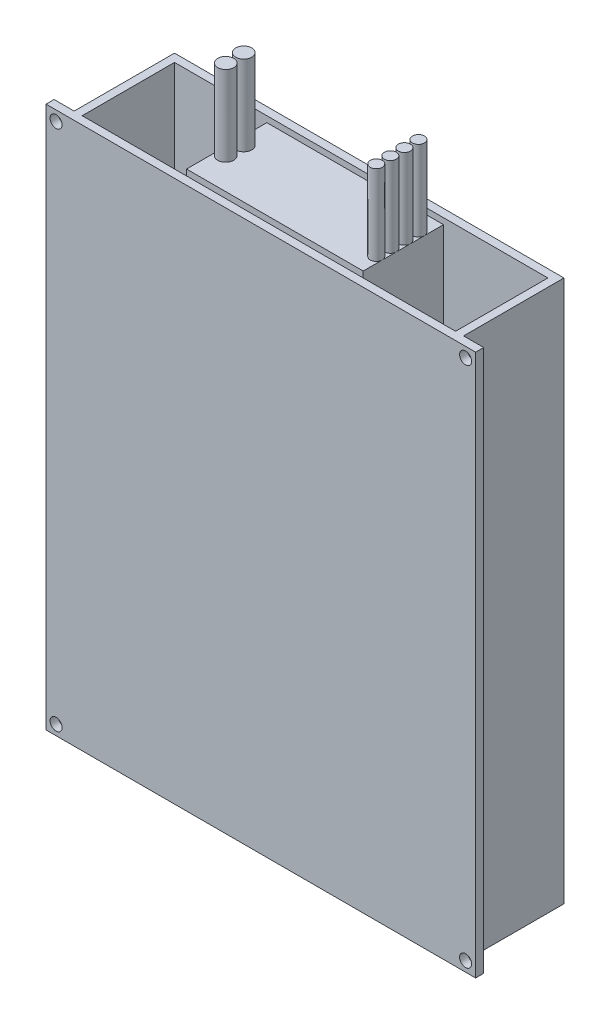
ISO-10303-21;
HEADER;
FILE_DESCRIPTION(('STEP AP214'),'2;1');
FILE_NAME('part.step','',(''),(''),'','','');
FILE_SCHEMA(('AUTOMOTIVE_DESIGN { 1 0 10303 214 1 1 1 1 }'));
ENDSEC;
DATA;
#1=APPLICATION_CONTEXT('core data for automotive mechanical design processes');
#2=APPLICATION_PROTOCOL_DEFINITION('international standard','automotive_design',2000,#1);
#3=PRODUCT_CONTEXT('',#1,'mechanical');
#4=PRODUCT('Part','Part','',(#3));
#5=PRODUCT_RELATED_PRODUCT_CATEGORY('part','',(#4));
#6=PRODUCT_DEFINITION_FORMATION('','',#4);
#7=PRODUCT_DEFINITION_CONTEXT('part definition',#1,'design');
#8=PRODUCT_DEFINITION('design','',#6,#7);
#9=PRODUCT_DEFINITION_SHAPE('','',#8);
#10=(LENGTH_UNIT() NAMED_UNIT(*) SI_UNIT(.MILLI.,.METRE.));
#11=(NAMED_UNIT(*) PLANE_ANGLE_UNIT() SI_UNIT($,.RADIAN.));
#12=(NAMED_UNIT(*) SI_UNIT($,.STERADIAN.) SOLID_ANGLE_UNIT());
#13=UNCERTAINTY_MEASURE_WITH_UNIT(LENGTH_MEASURE(1.E-05),#10,'distance_accuracy_value','');
#14=(GEOMETRIC_REPRESENTATION_CONTEXT(3) GLOBAL_UNCERTAINTY_ASSIGNED_CONTEXT((#13)) GLOBAL_UNIT_ASSIGNED_CONTEXT((#10,
#11,#12)) REPRESENTATION_CONTEXT('',''));
#15=CARTESIAN_POINT('',(0.,0.,0.));
#16=DIRECTION('',(0.,0.,1.));
#17=DIRECTION('',(1.,0.,0.));
#18=AXIS2_PLACEMENT_3D('',#15,#16,#17);
#19=CARTESIAN_POINT('',(0.,-70.0000000000004,-21.9067738994741));
#20=DIRECTION('',(0.,0.,1.));
#21=DIRECTION('',(0.,-1.,0.));
#22=AXIS2_PLACEMENT_3D('',#19,#20,#21);
#23=PLANE('',#22);
#24=CARTESIAN_POINT('',(-62.5797254283904,-67.5000000000003,-21.9067738994726));
#25=DIRECTION('',(0.,0.,-1.));
#26=DIRECTION('',(0.,1.,0.));
#27=AXIS2_PLACEMENT_3D('',#24,#25,#26);
#28=CIRCLE('',#27,1.5);
#29=CARTESIAN_POINT('',(-62.5797254283904,-66.0000000000003,-21.9067738994725));
#30=VERTEX_POINT('',#29);
#31=EDGE_CURVE('E270',#30,#30,#28,.F.);
#32=ORIENTED_EDGE('',*,*,#31,.F.);
#33=EDGE_LOOP('',(#32));
#34=FACE_BOUND('',#33,.T.);
#35=CARTESIAN_POINT('',(-164.579725428391,-67.5000000000003,-21.9067738994726));
#36=DIRECTION('',(0.,0.,-1.));
#37=DIRECTION('',(0.,1.,0.));
#38=AXIS2_PLACEMENT_3D('',#35,#36,#37);
#39=CIRCLE('',#38,1.50000000000003);
#40=CARTESIAN_POINT('',(-164.579725428391,-66.0000000000003,-21.9067738994725));
#41=VERTEX_POINT('',#40);
#42=EDGE_CURVE('E274',#41,#41,#39,.T.);
#43=ORIENTED_EDGE('',*,*,#42,.T.);
#44=EDGE_LOOP('',(#43));
#45=FACE_BOUND('',#44,.T.);
#46=CARTESIAN_POINT('',(-62.5797254283904,62.4999999999997,-21.9067738994712));
#47=DIRECTION('',(0.,0.,-1.));
#48=DIRECTION('',(0.,1.,0.));
#49=AXIS2_PLACEMENT_3D('',#46,#47,#48);
#50=CIRCLE('',#49,1.5);
#51=CARTESIAN_POINT('',(-62.5797254283904,63.9999999999997,-21.9067738994712));
#52=VERTEX_POINT('',#51);
#53=EDGE_CURVE('E163',#52,#52,#50,.T.);
#54=ORIENTED_EDGE('',*,*,#53,.T.);
#55=EDGE_LOOP('',(#54));
#56=FACE_BOUND('',#55,.T.);
#57=DIRECTION('',(1.,0.,0.));
#58=VECTOR('',#57,1.);
#59=CARTESIAN_POINT('',(0.,-70.0000000000004,-21.9067738994741));
#60=LINE('',#59,#58);
#61=CARTESIAN_POINT('',(-167.079725428391,-70.0000000000004,-21.906773899474));
#62=VERTEX_POINT('',#61);
#63=CARTESIAN_POINT('',(-60.0797254283904,-70.0000000000004,-21.906773899474));
#64=VERTEX_POINT('',#63);
#65=EDGE_CURVE('E161',#62,#64,#60,.T.);
#66=ORIENTED_EDGE('',*,*,#65,.T.);
#67=DIRECTION('',(0.,-1.,0.));
#68=VECTOR('',#67,1.);
#69=CARTESIAN_POINT('',(-60.0797254283904,70.3851648071343,-21.9067738994725));
#70=LINE('',#69,#68);
#71=CARTESIAN_POINT('',(-60.0797254283904,64.9999999999997,-21.9067738994726));
#72=VERTEX_POINT('',#71);
#73=EDGE_CURVE('E187',#72,#64,#70,.T.);
#74=ORIENTED_EDGE('',*,*,#73,.F.);
#75=DIRECTION('',(-1.,0.,0.));
#76=VECTOR('',#75,1.);
#77=CARTESIAN_POINT('',(0.,64.9999999999997,-21.9067738994727));
#78=LINE('',#77,#76);
#79=CARTESIAN_POINT('',(-167.079725428391,64.9999999999997,-21.9067738994726));
#80=VERTEX_POINT('',#79);
#81=EDGE_CURVE('E197',#72,#80,#78,.T.);
#82=ORIENTED_EDGE('',*,*,#81,.T.);
#83=DIRECTION('',(0.,-1.,0.));
#84=VECTOR('',#83,1.);
#85=CARTESIAN_POINT('',(-167.079725428391,70.3851648071343,-21.9067738994725));
#86=LINE('',#85,#84);
#87=EDGE_CURVE('E171',#80,#62,#86,.T.);
#88=ORIENTED_EDGE('',*,*,#87,.T.);
#89=EDGE_LOOP('',(#66,#74,#82,#88));
#90=FACE_BOUND('',#89,.T.);
#91=CARTESIAN_POINT('',(-164.579725428391,62.4999999999997,-21.9067738994712));
#92=DIRECTION('',(0.,0.,-1.));
#93=DIRECTION('',(0.,1.,0.));
#94=AXIS2_PLACEMENT_3D('',#91,#92,#93);
#95=CIRCLE('',#94,1.50000000000002);
#96=CARTESIAN_POINT('',(-164.579725428391,63.9999999999997,-21.9067738994712));
#97=VERTEX_POINT('',#96);
#98=EDGE_CURVE('E281',#97,#97,#95,.F.);
#99=ORIENTED_EDGE('',*,*,#98,.F.);
#100=EDGE_LOOP('',(#99));
#101=FACE_BOUND('',#100,.T.);
#102=ADVANCED_FACE('F49',(#34,#45,#56,#90,#101),#23,.T.);
#103=CARTESIAN_POINT('',(0.,70.3851648071344,-23.9067738994725));
#104=DIRECTION('',(0.,0.,-1.));
#105=DIRECTION('',(0.,1.,0.));
#106=AXIS2_PLACEMENT_3D('',#103,#104,#105);
#107=PLANE('',#106);
#108=DIRECTION('',(-1.,0.,0.));
#109=VECTOR('',#108,1.);
#110=CARTESIAN_POINT('',(0.,64.9999999999997,-23.9067738994726));
#111=LINE('',#110,#109);
#112=CARTESIAN_POINT('',(-60.0797254283904,64.9999999999997,-23.9067738994726));
#113=VERTEX_POINT('',#112);
#114=CARTESIAN_POINT('',(-65.0797254283904,64.9999999999997,-23.906773899474));
#115=VERTEX_POINT('',#114);
#116=EDGE_CURVE('E177',#113,#115,#111,.T.);
#117=ORIENTED_EDGE('',*,*,#116,.F.);
#118=DIRECTION('',(0.,-1.,0.));
#119=VECTOR('',#118,1.);
#120=CARTESIAN_POINT('',(-60.0797254283904,70.3851648071344,-23.9067738994725));
#121=LINE('',#120,#119);
#122=CARTESIAN_POINT('',(-60.0797254283904,-70.0000000000003,-23.906773899474));
#123=VERTEX_POINT('',#122);
#124=EDGE_CURVE('E180',#113,#123,#121,.T.);
#125=ORIENTED_EDGE('',*,*,#124,.T.);
#126=DIRECTION('',(1.,0.,0.));
#127=VECTOR('',#126,1.);
#128=CARTESIAN_POINT('',(0.,-70.0000000000003,-23.906773899474));
#129=LINE('',#128,#127);
#130=CARTESIAN_POINT('',(-65.0797254283904,-70.0000000000003,-23.906773899474));
#131=VERTEX_POINT('',#130);
#132=EDGE_CURVE('E72',#131,#123,#129,.T.);
#133=ORIENTED_EDGE('',*,*,#132,.F.);
#134=DIRECTION('',(0.,-1.,0.));
#135=VECTOR('',#134,1.);
#136=CARTESIAN_POINT('',(-65.0797254283904,70.3851648071344,-23.9067738994725));
#137=LINE('',#136,#135);
#138=EDGE_CURVE('E189',#115,#131,#137,.T.);
#139=ORIENTED_EDGE('',*,*,#138,.F.);
#140=EDGE_LOOP('',(#117,#125,#133,#139));
#141=FACE_BOUND('',#140,.T.);
#142=CARTESIAN_POINT('',(-62.5797254283904,62.4999999999997,-23.9067738994726));
#143=DIRECTION('',(0.,0.,-1.));
#144=DIRECTION('',(0.,1.,0.));
#145=AXIS2_PLACEMENT_3D('',#142,#143,#144);
#146=CIRCLE('',#145,1.5);
#147=CARTESIAN_POINT('',(-62.5797254283904,63.9999999999997,-23.9067738994726));
#148=VERTEX_POINT('',#147);
#149=EDGE_CURVE('E166',#148,#148,#146,.T.);
#150=ORIENTED_EDGE('',*,*,#149,.F.);
#151=EDGE_LOOP('',(#150));
#152=FACE_BOUND('',#151,.T.);
#153=CARTESIAN_POINT('',(-62.5797254283904,-67.5000000000003,-23.906773899474));
#154=DIRECTION('',(0.,0.,-1.));
#155=DIRECTION('',(0.,1.,0.));
#156=AXIS2_PLACEMENT_3D('',#153,#154,#155);
#157=CIRCLE('',#156,1.5);
#158=CARTESIAN_POINT('',(-62.5797254283904,-66.0000000000003,-23.906773899474));
#159=VERTEX_POINT('',#158);
#160=EDGE_CURVE('E293',#159,#159,#157,.F.);
#161=ORIENTED_EDGE('',*,*,#160,.T.);
#162=EDGE_LOOP('',(#161));
#163=FACE_BOUND('',#162,.T.);
#164=ADVANCED_FACE('F251',(#141,#152,#163),#107,.T.);
#165=CARTESIAN_POINT('',(0.,70.3851648071344,-23.9067738994725));
#166=DIRECTION('',(0.,0.,-1.));
#167=DIRECTION('',(0.,1.,0.));
#168=AXIS2_PLACEMENT_3D('',#165,#166,#167);
#169=PLANE('',#168);
#170=DIRECTION('',(-1.,0.,0.));
#171=VECTOR('',#170,1.);
#172=CARTESIAN_POINT('',(0.,64.9999999999997,-23.9067738994726));
#173=LINE('',#172,#171);
#174=CARTESIAN_POINT('',(-162.07972542839,64.9999999999997,-23.9067738994733));
#175=VERTEX_POINT('',#174);
#176=CARTESIAN_POINT('',(-167.079725428391,64.9999999999997,-23.9067738994726));
#177=VERTEX_POINT('',#176);
#178=EDGE_CURVE('E174',#175,#177,#173,.T.);
#179=ORIENTED_EDGE('',*,*,#178,.F.);
#180=DIRECTION('',(0.,-1.,0.));
#181=VECTOR('',#180,1.);
#182=CARTESIAN_POINT('',(-162.07972542839,70.3851648071344,-23.9067738994725));
#183=LINE('',#182,#181);
#184=CARTESIAN_POINT('',(-162.07972542839,-70.0000000000003,-23.906773899474));
#185=VERTEX_POINT('',#184);
#186=EDGE_CURVE('E64',#175,#185,#183,.T.);
#187=ORIENTED_EDGE('',*,*,#186,.T.);
#188=DIRECTION('',(1.,0.,0.));
#189=VECTOR('',#188,1.);
#190=CARTESIAN_POINT('',(0.,-70.0000000000003,-23.906773899474));
#191=LINE('',#190,#189);
#192=CARTESIAN_POINT('',(-167.079725428391,-70.0000000000003,-23.906773899474));
#193=VERTEX_POINT('',#192);
#194=EDGE_CURVE('E150',#193,#185,#191,.T.);
#195=ORIENTED_EDGE('',*,*,#194,.F.);
#196=DIRECTION('',(0.,-1.,0.));
#197=VECTOR('',#196,1.);
#198=CARTESIAN_POINT('',(-167.079725428391,70.3851648071344,-23.9067738994725));
#199=LINE('',#198,#197);
#200=EDGE_CURVE('E140',#177,#193,#199,.T.);
#201=ORIENTED_EDGE('',*,*,#200,.F.);
#202=EDGE_LOOP('',(#179,#187,#195,#201));
#203=FACE_BOUND('',#202,.T.);
#204=CARTESIAN_POINT('',(-164.579725428391,-67.5000000000003,-23.906773899474));
#205=DIRECTION('',(0.,0.,-1.));
#206=DIRECTION('',(0.,1.,0.));
#207=AXIS2_PLACEMENT_3D('',#204,#205,#206);
#208=CIRCLE('',#207,1.50000000000003);
#209=CARTESIAN_POINT('',(-164.579725428391,-66.0000000000003,-23.906773899474));
#210=VERTEX_POINT('',#209);
#211=EDGE_CURVE('E289',#210,#210,#208,.T.);
#212=ORIENTED_EDGE('',*,*,#211,.F.);
#213=EDGE_LOOP('',(#212));
#214=FACE_BOUND('',#213,.T.);
#215=CARTESIAN_POINT('',(-164.579725428391,62.4999999999997,-23.9067738994726));
#216=DIRECTION('',(0.,0.,-1.));
#217=DIRECTION('',(0.,1.,0.));
#218=AXIS2_PLACEMENT_3D('',#215,#216,#217);
#219=CIRCLE('',#218,1.50000000000002);
#220=CARTESIAN_POINT('',(-164.579725428391,63.9999999999997,-23.9067738994726));
#221=VERTEX_POINT('',#220);
#222=EDGE_CURVE('E283',#221,#221,#219,.F.);
#223=ORIENTED_EDGE('',*,*,#222,.T.);
#224=EDGE_LOOP('',(#223));
#225=FACE_BOUND('',#224,.T.);
#226=ADVANCED_FACE('F153',(#203,#214,#225),#169,.T.);
#227=CARTESIAN_POINT('',(-65.0797254283904,-70.0000000000006,-7.30598239080664E-13));
#228=DIRECTION('',(-1.,0.,0.));
#229=DIRECTION('',(0.,-1.,0.));
#230=AXIS2_PLACEMENT_3D('',#227,#228,#229);
#231=PLANE('',#230);
#232=DIRECTION('',(0.,0.,-1.));
#233=VECTOR('',#232,1.);
#234=CARTESIAN_POINT('',(-65.0797254283904,64.9999999999995,6.83451703150806E-13));
#235=LINE('',#234,#233);
#236=CARTESIAN_POINT('',(-65.0797254283904,65.,-48.9067738994723));
#237=VERTEX_POINT('',#236);
#238=EDGE_CURVE('E208',#115,#237,#235,.T.);
#239=ORIENTED_EDGE('',*,*,#238,.F.);
#240=ORIENTED_EDGE('',*,*,#138,.T.);
#241=DIRECTION('',(0.,0.,1.));
#242=VECTOR('',#241,1.);
#243=CARTESIAN_POINT('',(-65.0797254283904,-70.0000000000006,-7.30598239080664E-13));
#244=LINE('',#243,#242);
#245=CARTESIAN_POINT('',(-65.0797254283904,-70.0000000000001,-48.9067738994738));
#246=VERTEX_POINT('',#245);
#247=EDGE_CURVE('E210',#246,#131,#244,.T.);
#248=ORIENTED_EDGE('',*,*,#247,.F.);
#249=DIRECTION('',(0.,1.,0.));
#250=VECTOR('',#249,1.);
#251=CARTESIAN_POINT('',(-65.0797254283904,-70.0000000000001,-48.9067738994738));
#252=LINE('',#251,#250);
#253=EDGE_CURVE('E57',#246,#237,#252,.T.);
#254=ORIENTED_EDGE('',*,*,#253,.T.);
#255=EDGE_LOOP('',(#239,#240,#248,#254));
#256=FACE_BOUND('',#255,.T.);
#257=ADVANCED_FACE('F51',(#256),#231,.F.);
#258=CARTESIAN_POINT('',(-162.07972542839,-70.0000000000006,-7.30598239080664E-13));
#259=DIRECTION('',(-1.,0.,0.));
#260=DIRECTION('',(0.,-1.,0.));
#261=AXIS2_PLACEMENT_3D('',#258,#259,#260);
#262=PLANE('',#261);
#263=ORIENTED_EDGE('',*,*,#186,.F.);
#264=DIRECTION('',(0.,0.,-1.));
#265=VECTOR('',#264,1.);
#266=CARTESIAN_POINT('',(-162.07972542839,64.9999999999995,6.83451703150806E-13));
#267=LINE('',#266,#265);
#268=CARTESIAN_POINT('',(-162.07972542839,65.,-48.9067738994737));
#269=VERTEX_POINT('',#268);
#270=EDGE_CURVE('E201',#175,#269,#267,.T.);
#271=ORIENTED_EDGE('',*,*,#270,.T.);
#272=DIRECTION('',(0.,1.,0.));
#273=VECTOR('',#272,1.);
#274=CARTESIAN_POINT('',(-162.07972542839,-70.0000000000001,-48.9067738994738));
#275=LINE('',#274,#273);
#276=CARTESIAN_POINT('',(-162.07972542839,-70.0000000000001,-48.9067738994738));
#277=VERTEX_POINT('',#276);
#278=EDGE_CURVE('E12',#277,#269,#275,.T.);
#279=ORIENTED_EDGE('',*,*,#278,.F.);
#280=DIRECTION('',(0.,0.,1.));
#281=VECTOR('',#280,1.);
#282=CARTESIAN_POINT('',(-162.07972542839,-70.0000000000006,-7.30598239080664E-13));
#283=LINE('',#282,#281);
#284=EDGE_CURVE('E234',#277,#185,#283,.T.);
#285=ORIENTED_EDGE('',*,*,#284,.T.);
#286=EDGE_LOOP('',(#263,#271,#279,#285));
#287=FACE_BOUND('',#286,.T.);
#288=ADVANCED_FACE('F253',(#287),#262,.T.);
#289=CARTESIAN_POINT('',(0.,-70.0000000000001,-48.9067738994738));
#290=DIRECTION('',(0.,0.,1.));
#291=DIRECTION('',(0.,-1.,0.));
#292=AXIS2_PLACEMENT_3D('',#289,#290,#291);
#293=PLANE('',#292);
#294=ORIENTED_EDGE('',*,*,#278,.T.);
#295=DIRECTION('',(-1.,0.,0.));
#296=VECTOR('',#295,1.);
#297=CARTESIAN_POINT('',(0.,65.,-48.9067738994723));
#298=LINE('',#297,#296);
#299=EDGE_CURVE('E205',#237,#269,#298,.T.);
#300=ORIENTED_EDGE('',*,*,#299,.F.);
#301=ORIENTED_EDGE('',*,*,#253,.F.);
#302=DIRECTION('',(1.,0.,0.));
#303=VECTOR('',#302,1.);
#304=CARTESIAN_POINT('',(0.,-70.0000000000001,-48.9067738994738));
#305=LINE('',#304,#303);
#306=EDGE_CURVE('E236',#277,#246,#305,.T.);
#307=ORIENTED_EDGE('',*,*,#306,.F.);
#308=EDGE_LOOP('',(#294,#300,#301,#307));
#309=FACE_BOUND('',#308,.T.);
#310=ADVANCED_FACE('F245',(#309),#293,.F.);
#311=CARTESIAN_POINT('',(0.,-70.0000000000006,-7.30598239080664E-13));
#312=DIRECTION('',(0.,-1.,0.));
#313=DIRECTION('',(0.,0.,-1.));
#314=AXIS2_PLACEMENT_3D('',#311,#312,#313);
#315=PLANE('',#314);
#316=ORIENTED_EDGE('',*,*,#247,.T.);
#317=ORIENTED_EDGE('',*,*,#132,.T.);
#318=DIRECTION('',(0.,0.,-1.));
#319=VECTOR('',#318,1.);
#320=CARTESIAN_POINT('',(-60.0797254283904,-70.0000000000006,-7.34431028084668E-13));
#321=LINE('',#320,#319);
#322=EDGE_CURVE('E176',#64,#123,#321,.T.);
#323=ORIENTED_EDGE('',*,*,#322,.F.);
#324=ORIENTED_EDGE('',*,*,#65,.F.);
#325=DIRECTION('',(0.,0.,-1.));
#326=VECTOR('',#325,1.);
#327=CARTESIAN_POINT('',(-167.079725428391,-70.0000000000006,-7.34431028084668E-13));
#328=LINE('',#327,#326);
#329=EDGE_CURVE('E145',#62,#193,#328,.T.);
#330=ORIENTED_EDGE('',*,*,#329,.T.);
#331=ORIENTED_EDGE('',*,*,#194,.T.);
#332=ORIENTED_EDGE('',*,*,#284,.F.);
#333=ORIENTED_EDGE('',*,*,#306,.T.);
#334=EDGE_LOOP('',(#316,#317,#323,#324,#330,#331,#332,#333));
#335=FACE_BOUND('',#334,.T.);
#336=ADVANCED_FACE('F159',(#335),#315,.T.);
#337=CARTESIAN_POINT('',(-67.0797254283904,165.687635785134,1.73809870733891E-12));
#338=DIRECTION('',(1.,0.,0.));
#339=DIRECTION('',(0.,1.,0.));
#340=AXIS2_PLACEMENT_3D('',#337,#338,#339);
#341=PLANE('',#340);
#342=DIRECTION('',(0.,-1.,0.));
#343=VECTOR('',#342,1.);
#344=CARTESIAN_POINT('',(-67.0797254283904,165.687635785135,-23.9067738994716));
#345=LINE('',#344,#343);
#346=CARTESIAN_POINT('',(-67.0797254283904,64.9999999999997,-23.9067738994716));
#347=VERTEX_POINT('',#346);
#348=CARTESIAN_POINT('',(-67.0797254283904,-68.0000000000003,-23.9067738994741));
#349=VERTEX_POINT('',#348);
#350=EDGE_CURVE('E221',#347,#349,#345,.T.);
#351=ORIENTED_EDGE('',*,*,#350,.F.);
#352=DIRECTION('',(0.,0.,-1.));
#353=VECTOR('',#352,1.);
#354=CARTESIAN_POINT('',(-67.0797254283904,64.9999999999995,6.83451703150806E-13));
#355=LINE('',#354,#353);
#356=CARTESIAN_POINT('',(-67.0797254283904,64.9999999999999,-46.9067738994723));
#357=VERTEX_POINT('',#356);
#358=EDGE_CURVE('E203',#347,#357,#355,.T.);
#359=ORIENTED_EDGE('',*,*,#358,.T.);
#360=DIRECTION('',(0.,-1.,0.));
#361=VECTOR('',#360,1.);
#362=CARTESIAN_POINT('',(-67.0797254283904,165.687635785135,-46.9067738994713));
#363=LINE('',#362,#361);
#364=CARTESIAN_POINT('',(-67.0797254283904,-68.0000000000001,-46.9067738994737));
#365=VERTEX_POINT('',#364);
#366=EDGE_CURVE('E226',#357,#365,#363,.T.);
#367=ORIENTED_EDGE('',*,*,#366,.T.);
#368=DIRECTION('',(0.,0.,1.));
#369=VECTOR('',#368,1.);
#370=CARTESIAN_POINT('',(-67.0797254283904,-68.0000000000006,-7.09649351047605E-13));
#371=LINE('',#370,#369);
#372=EDGE_CURVE('E213',#365,#349,#371,.T.);
#373=ORIENTED_EDGE('',*,*,#372,.T.);
#374=EDGE_LOOP('',(#351,#359,#367,#373));
#375=FACE_BOUND('',#374,.T.);
#376=ADVANCED_FACE('F340',(#375),#341,.F.);
#377=CARTESIAN_POINT('',(0.,165.687635785135,-46.9067738994713));
#378=DIRECTION('',(0.,0.,-1.));
#379=DIRECTION('',(0.,1.,0.));
#380=AXIS2_PLACEMENT_3D('',#377,#378,#379);
#381=PLANE('',#380);
#382=ORIENTED_EDGE('',*,*,#366,.F.);
#383=DIRECTION('',(-1.,0.,0.));
#384=VECTOR('',#383,1.);
#385=CARTESIAN_POINT('',(0.,65.,-46.9067738994723));
#386=LINE('',#385,#384);
#387=CARTESIAN_POINT('',(-160.07972542839,65.,-46.9067738994723));
#388=VERTEX_POINT('',#387);
#389=EDGE_CURVE('E193',#357,#388,#386,.T.);
#390=ORIENTED_EDGE('',*,*,#389,.T.);
#391=DIRECTION('',(0.,-1.,0.));
#392=VECTOR('',#391,1.);
#393=CARTESIAN_POINT('',(-160.07972542839,165.687635785135,-46.9067738994713));
#394=LINE('',#393,#392);
#395=CARTESIAN_POINT('',(-160.07972542839,-68.0000000000001,-46.9067738994737));
#396=VERTEX_POINT('',#395);
#397=EDGE_CURVE('E224',#388,#396,#394,.T.);
#398=ORIENTED_EDGE('',*,*,#397,.T.);
#399=DIRECTION('',(1.,0.,0.));
#400=VECTOR('',#399,1.);
#401=CARTESIAN_POINT('',(0.,-68.0000000000001,-46.9067738994737));
#402=LINE('',#401,#400);
#403=EDGE_CURVE('E215',#396,#365,#402,.T.);
#404=ORIENTED_EDGE('',*,*,#403,.T.);
#405=EDGE_LOOP('',(#382,#390,#398,#404));
#406=FACE_BOUND('',#405,.T.);
#407=ADVANCED_FACE('F336',(#406),#381,.F.);
#408=CARTESIAN_POINT('',(-160.07972542839,165.687635785134,1.73809870733891E-12));
#409=DIRECTION('',(1.,0.,0.));
#410=DIRECTION('',(0.,1.,0.));
#411=AXIS2_PLACEMENT_3D('',#408,#409,#410);
#412=PLANE('',#411);
#413=DIRECTION('',(0.,0.,-1.));
#414=VECTOR('',#413,1.);
#415=CARTESIAN_POINT('',(-160.07972542839,64.9999999999995,6.83451703150806E-13));
#416=LINE('',#415,#414);
#417=CARTESIAN_POINT('',(-160.07972542839,64.9999999999997,-23.9067738994716));
#418=VERTEX_POINT('',#417);
#419=EDGE_CURVE('E196',#418,#388,#416,.T.);
#420=ORIENTED_EDGE('',*,*,#419,.F.);
#421=DIRECTION('',(0.,-1.,0.));
#422=VECTOR('',#421,1.);
#423=CARTESIAN_POINT('',(-160.07972542839,165.687635785135,-23.9067738994716));
#424=LINE('',#423,#422);
#425=CARTESIAN_POINT('',(-160.07972542839,-68.0000000000003,-23.9067738994741));
#426=VERTEX_POINT('',#425);
#427=EDGE_CURVE('E222',#418,#426,#424,.T.);
#428=ORIENTED_EDGE('',*,*,#427,.T.);
#429=DIRECTION('',(0.,0.,1.));
#430=VECTOR('',#429,1.);
#431=CARTESIAN_POINT('',(-160.07972542839,-68.0000000000006,-7.09649351047605E-13));
#432=LINE('',#431,#430);
#433=EDGE_CURVE('E218',#396,#426,#432,.T.);
#434=ORIENTED_EDGE('',*,*,#433,.F.);
#435=ORIENTED_EDGE('',*,*,#397,.F.);
#436=EDGE_LOOP('',(#420,#428,#434,#435));
#437=FACE_BOUND('',#436,.T.);
#438=ADVANCED_FACE('F333',(#437),#412,.T.);
#439=CARTESIAN_POINT('',(0.,165.687635785135,-23.9067738994716));
#440=DIRECTION('',(0.,0.,-1.));
#441=DIRECTION('',(0.,1.,0.));
#442=AXIS2_PLACEMENT_3D('',#439,#440,#441);
#443=PLANE('',#442);
#444=DIRECTION('',(-1.,0.,0.));
#445=VECTOR('',#444,1.);
#446=CARTESIAN_POINT('',(0.,64.9999999999997,-23.9067738994727));
#447=LINE('',#446,#445);
#448=EDGE_CURVE('E199',#347,#418,#447,.T.);
#449=ORIENTED_EDGE('',*,*,#448,.F.);
#450=ORIENTED_EDGE('',*,*,#350,.T.);
#451=DIRECTION('',(1.,0.,0.));
#452=VECTOR('',#451,1.);
#453=CARTESIAN_POINT('',(0.,-68.0000000000003,-23.9067738994741));
#454=LINE('',#453,#452);
#455=EDGE_CURVE('E183',#426,#349,#454,.T.);
#456=ORIENTED_EDGE('',*,*,#455,.F.);
#457=ORIENTED_EDGE('',*,*,#427,.F.);
#458=EDGE_LOOP('',(#449,#450,#456,#457));
#459=FACE_BOUND('',#458,.T.);
#460=ADVANCED_FACE('F332',(#459),#443,.T.);
#461=CARTESIAN_POINT('',(-135.57972542839,65.,-45.4067738994724));
#462=DIRECTION('',(0.,-1.,0.));
#463=DIRECTION('',(-1.,0.,0.));
#464=AXIS2_PLACEMENT_3D('',#461,#462,#463);
#465=PLANE('',#464);
#466=ORIENTED_EDGE('',*,*,#81,.F.);
#467=DIRECTION('',(0.,0.,1.));
#468=VECTOR('',#467,1.);
#469=CARTESIAN_POINT('',(-60.0797254283904,64.9999999999995,6.80303590286341E-13));
#470=LINE('',#469,#468);
#471=EDGE_CURVE('E179',#113,#72,#470,.T.);
#472=ORIENTED_EDGE('',*,*,#471,.F.);
#473=ORIENTED_EDGE('',*,*,#116,.T.);
#474=ORIENTED_EDGE('',*,*,#238,.T.);
#475=ORIENTED_EDGE('',*,*,#299,.T.);
#476=ORIENTED_EDGE('',*,*,#270,.F.);
#477=ORIENTED_EDGE('',*,*,#178,.T.);
#478=DIRECTION('',(0.,0.,1.));
#479=VECTOR('',#478,1.);
#480=CARTESIAN_POINT('',(-167.079725428391,64.9999999999995,6.80303590286341E-13));
#481=LINE('',#480,#479);
#482=EDGE_CURVE('E147',#177,#80,#481,.T.);
#483=ORIENTED_EDGE('',*,*,#482,.T.);
#484=EDGE_LOOP('',(#466,#472,#473,#474,#475,#476,#477,#483));
#485=FACE_BOUND('',#484,.T.);
#486=ORIENTED_EDGE('',*,*,#448,.T.);
#487=ORIENTED_EDGE('',*,*,#419,.T.);
#488=ORIENTED_EDGE('',*,*,#389,.F.);
#489=ORIENTED_EDGE('',*,*,#358,.F.);
#490=EDGE_LOOP('',(#486,#487,#488,#489));
#491=FACE_BOUND('',#490,.T.);
#492=ADVANCED_FACE('F247',(#485,#491),#465,.F.);
#493=CARTESIAN_POINT('',(0.,-68.0000000000006,-7.09649351047605E-13));
#494=DIRECTION('',(0.,-1.,0.));
#495=DIRECTION('',(0.,0.,-1.));
#496=AXIS2_PLACEMENT_3D('',#493,#494,#495);
#497=PLANE('',#496);
#498=ORIENTED_EDGE('',*,*,#372,.F.);
#499=ORIENTED_EDGE('',*,*,#403,.F.);
#500=ORIENTED_EDGE('',*,*,#433,.T.);
#501=ORIENTED_EDGE('',*,*,#455,.T.);
#502=EDGE_LOOP('',(#498,#499,#500,#501));
#503=FACE_BOUND('',#502,.T.);
#504=ADVANCED_FACE('F328',(#503),#497,.F.);
#505=CARTESIAN_POINT('',(-60.0797254283904,70.3851648071341,7.36710197578457E-13));
#506=DIRECTION('',(-1.,0.,0.));
#507=DIRECTION('',(0.,-1.,0.));
#508=AXIS2_PLACEMENT_3D('',#505,#506,#507);
#509=PLANE('',#508);
#510=ORIENTED_EDGE('',*,*,#124,.F.);
#511=ORIENTED_EDGE('',*,*,#471,.T.);
#512=ORIENTED_EDGE('',*,*,#73,.T.);
#513=ORIENTED_EDGE('',*,*,#322,.T.);
#514=EDGE_LOOP('',(#510,#511,#512,#513));
#515=FACE_BOUND('',#514,.T.);
#516=ADVANCED_FACE('F324',(#515),#509,.F.);
#517=CARTESIAN_POINT('',(-167.079725428391,70.3851648071341,7.36710197578457E-13));
#518=DIRECTION('',(-1.,0.,0.));
#519=DIRECTION('',(0.,-1.,0.));
#520=AXIS2_PLACEMENT_3D('',#517,#518,#519);
#521=PLANE('',#520);
#522=ORIENTED_EDGE('',*,*,#482,.F.);
#523=ORIENTED_EDGE('',*,*,#200,.T.);
#524=ORIENTED_EDGE('',*,*,#329,.F.);
#525=ORIENTED_EDGE('',*,*,#87,.F.);
#526=EDGE_LOOP('',(#522,#523,#524,#525));
#527=FACE_BOUND('',#526,.T.);
#528=ADVANCED_FACE('F142',(#527),#521,.T.);
#529=CARTESIAN_POINT('',(-164.579725428391,-67.5000000000003,-21.9067738994726));
#530=DIRECTION('',(0.,0.,-1.));
#531=DIRECTION('',(0.,1.,0.));
#532=AXIS2_PLACEMENT_3D('',#529,#530,#531);
#533=CYLINDRICAL_SURFACE('',#532,1.50000000000003);
#534=ORIENTED_EDGE('',*,*,#42,.F.);
#535=EDGE_LOOP('',(#534));
#536=FACE_BOUND('',#535,.T.);
#537=ORIENTED_EDGE('',*,*,#211,.T.);
#538=EDGE_LOOP('',(#537));
#539=FACE_BOUND('',#538,.T.);
#540=ADVANCED_FACE('F300',(#536,#539),#533,.F.);
#541=CARTESIAN_POINT('',(-164.579725428391,62.4999999999997,-21.9067738994712));
#542=DIRECTION('',(0.,0.,-1.));
#543=DIRECTION('',(0.,1.,0.));
#544=AXIS2_PLACEMENT_3D('',#541,#542,#543);
#545=CYLINDRICAL_SURFACE('',#544,1.50000000000002);
#546=ORIENTED_EDGE('',*,*,#98,.T.);
#547=EDGE_LOOP('',(#546));
#548=FACE_BOUND('',#547,.T.);
#549=ORIENTED_EDGE('',*,*,#222,.F.);
#550=EDGE_LOOP('',(#549));
#551=FACE_BOUND('',#550,.T.);
#552=ADVANCED_FACE('F306',(#548,#551),#545,.F.);
#553=CARTESIAN_POINT('',(-62.5797254283904,62.4999999999997,-21.9067738994712));
#554=DIRECTION('',(0.,0.,-1.));
#555=DIRECTION('',(0.,1.,0.));
#556=AXIS2_PLACEMENT_3D('',#553,#554,#555);
#557=CYLINDRICAL_SURFACE('',#556,1.5);
#558=ORIENTED_EDGE('',*,*,#53,.F.);
#559=EDGE_LOOP('',(#558));
#560=FACE_BOUND('',#559,.T.);
#561=ORIENTED_EDGE('',*,*,#149,.T.);
#562=EDGE_LOOP('',(#561));
#563=FACE_BOUND('',#562,.T.);
#564=ADVANCED_FACE('F308',(#560,#563),#557,.F.);
#565=CARTESIAN_POINT('',(-62.5797254283904,-67.5000000000003,-21.9067738994726));
#566=DIRECTION('',(0.,0.,-1.));
#567=DIRECTION('',(0.,1.,0.));
#568=AXIS2_PLACEMENT_3D('',#565,#566,#567);
#569=CYLINDRICAL_SURFACE('',#568,1.5);
#570=ORIENTED_EDGE('',*,*,#31,.T.);
#571=EDGE_LOOP('',(#570));
#572=FACE_BOUND('',#571,.T.);
#573=ORIENTED_EDGE('',*,*,#160,.F.);
#574=EDGE_LOOP('',(#573));
#575=FACE_BOUND('',#574,.T.);
#576=ADVANCED_FACE('F314',(#572,#575),#569,.F.);
#577=CLOSED_SHELL('',(#102,#164,#226,#257,#288,#310,#336,#376,#407,#438,#460,#492,#504,#516,
#528,#540,#552,#564,#576));
#578=MANIFOLD_SOLID_BREP('B2',#577);
#579=CARTESIAN_POINT('',(-135.57972542839,-68.0000000000001,-45.4067738994738));
#580=DIRECTION('',(0.,1.,0.));
#581=DIRECTION('',(1.,0.,0.));
#582=AXIS2_PLACEMENT_3D('',#579,#580,#581);
#583=PLANE('',#582);
#584=DIRECTION('',(-1.,0.,0.));
#585=VECTOR('',#584,1.);
#586=CARTESIAN_POINT('',(-135.57972542839,-68.0000000000003,-25.4067738994738));
#587=LINE('',#586,#585);
#588=CARTESIAN_POINT('',(-91.5797254283904,-68.0000000000003,-25.406773899474));
#589=VERTEX_POINT('',#588);
#590=CARTESIAN_POINT('',(-135.57972542839,-68.0000000000003,-25.4067738994738));
#591=VERTEX_POINT('',#590);
#592=EDGE_CURVE('E635',#589,#591,#587,.T.);
#593=ORIENTED_EDGE('',*,*,#592,.T.);
#594=DIRECTION('',(0.,0.,1.));
#595=VECTOR('',#594,1.);
#596=CARTESIAN_POINT('',(-135.57972542839,-68.0000000000001,-45.4067738994738));
#597=LINE('',#596,#595);
#598=CARTESIAN_POINT('',(-135.57972542839,-68.0000000000001,-45.4067738994738));
#599=VERTEX_POINT('',#598);
#600=EDGE_CURVE('E47',#599,#591,#597,.T.);
#601=ORIENTED_EDGE('',*,*,#600,.F.);
#602=DIRECTION('',(-1.,0.,0.));
#603=VECTOR('',#602,1.);
#604=CARTESIAN_POINT('',(-135.57972542839,-68.0000000000001,-45.4067738994738));
#605=LINE('',#604,#603);
#606=CARTESIAN_POINT('',(-91.5797254283904,-68.0000000000001,-45.406773899474));
#607=VERTEX_POINT('',#606);
#608=EDGE_CURVE('E638',#607,#599,#605,.T.);
#609=ORIENTED_EDGE('',*,*,#608,.F.);
#610=DIRECTION('',(0.,0.,1.));
#611=VECTOR('',#610,1.);
#612=CARTESIAN_POINT('',(-91.5797254283904,-68.0000000000001,-45.406773899474));
#613=LINE('',#612,#611);
#614=EDGE_CURVE('E591',#607,#589,#613,.T.);
#615=ORIENTED_EDGE('',*,*,#614,.T.);
#616=EDGE_LOOP('',(#593,#601,#609,#615));
#617=FACE_BOUND('',#616,.T.);
#618=ADVANCED_FACE('F515',(#617),#583,.F.);
#619=CARTESIAN_POINT('',(-135.57972542839,65.,-45.4067738994724));
#620=DIRECTION('',(1.,0.,0.));
#621=DIRECTION('',(0.,-1.,0.));
#622=AXIS2_PLACEMENT_3D('',#619,#620,#621);
#623=PLANE('',#622);
#624=DIRECTION('',(0.,1.,0.));
#625=VECTOR('',#624,1.);
#626=CARTESIAN_POINT('',(-135.57972542839,64.9999999999997,-25.4067738994724));
#627=LINE('',#626,#625);
#628=CARTESIAN_POINT('',(-135.57972542839,64.9999999999997,-25.4067738994724));
#629=VERTEX_POINT('',#628);
#630=EDGE_CURVE('E646',#591,#629,#627,.T.);
#631=ORIENTED_EDGE('',*,*,#630,.T.);
#632=DIRECTION('',(0.,0.,1.));
#633=VECTOR('',#632,1.);
#634=CARTESIAN_POINT('',(-135.57972542839,65.,-45.4067738994724));
#635=LINE('',#634,#633);
#636=CARTESIAN_POINT('',(-135.57972542839,64.9999999999998,-33.1567738994724));
#637=VERTEX_POINT('',#636);
#638=EDGE_CURVE('E594',#637,#629,#635,.T.);
#639=ORIENTED_EDGE('',*,*,#638,.F.);
#640=CARTESIAN_POINT('',(-135.57972542839,64.9999999999999,-37.6567738994724));
#641=VERTEX_POINT('',#640);
#642=EDGE_CURVE('E598',#641,#637,#635,.T.);
#643=ORIENTED_EDGE('',*,*,#642,.F.);
#644=CARTESIAN_POINT('',(-135.57972542839,65.,-45.4067738994724));
#645=VERTEX_POINT('',#644);
#646=EDGE_CURVE('E523',#645,#641,#635,.T.);
#647=ORIENTED_EDGE('',*,*,#646,.F.);
#648=DIRECTION('',(0.,1.,0.));
#649=VECTOR('',#648,1.);
#650=CARTESIAN_POINT('',(-135.57972542839,65.,-45.4067738994724));
#651=LINE('',#650,#649);
#652=EDGE_CURVE('E560',#599,#645,#651,.T.);
#653=ORIENTED_EDGE('',*,*,#652,.F.);
#654=ORIENTED_EDGE('',*,*,#600,.T.);
#655=EDGE_LOOP('',(#631,#639,#643,#647,#653,#654));
#656=FACE_BOUND('',#655,.T.);
#657=ADVANCED_FACE('F651',(#656),#623,.F.);
#658=CARTESIAN_POINT('',(-135.57972542839,65.,-45.4067738994724));
#659=DIRECTION('',(0.,-1.,0.));
#660=DIRECTION('',(-1.,0.,0.));
#661=AXIS2_PLACEMENT_3D('',#658,#659,#660);
#662=PLANE('',#661);
#663=DIRECTION('',(0.,0.,1.));
#664=VECTOR('',#663,1.);
#665=CARTESIAN_POINT('',(-91.5797254283904,65.,-45.4067738994726));
#666=LINE('',#665,#664);
#667=CARTESIAN_POINT('',(-91.5797254283904,64.9999999999998,-30.1567738994726));
#668=VERTEX_POINT('',#667);
#669=CARTESIAN_POINT('',(-91.5797254283904,64.9999999999997,-25.4067738994726));
#670=VERTEX_POINT('',#669);
#671=EDGE_CURVE('E549',#668,#670,#666,.T.);
#672=ORIENTED_EDGE('',*,*,#671,.F.);
#673=CARTESIAN_POINT('',(-93.0797254283904,64.9999999999998,-30.1567738994726));
#674=DIRECTION('',(0.,1.,0.));
#675=DIRECTION('',(1.,0.,0.));
#676=AXIS2_PLACEMENT_3D('',#673,#674,#675);
#677=CIRCLE('',#676,1.5);
#678=EDGE_CURVE('E588',#668,#668,#677,.T.);
#679=ORIENTED_EDGE('',*,*,#678,.F.);
#680=CARTESIAN_POINT('',(-91.5797254283904,64.9999999999998,-33.6567738994726));
#681=VERTEX_POINT('',#680);
#682=EDGE_CURVE('E578',#681,#668,#666,.T.);
#683=ORIENTED_EDGE('',*,*,#682,.F.);
#684=CARTESIAN_POINT('',(-93.0797254283904,64.9999999999998,-33.6567738994726));
#685=DIRECTION('',(0.,1.,0.));
#686=DIRECTION('',(1.,0.,0.));
#687=AXIS2_PLACEMENT_3D('',#684,#685,#686);
#688=CIRCLE('',#687,1.5);
#689=EDGE_CURVE('E604',#681,#681,#688,.T.);
#690=ORIENTED_EDGE('',*,*,#689,.F.);
#691=CARTESIAN_POINT('',(-91.5797254283904,64.9999999999998,-37.1567738994726));
#692=VERTEX_POINT('',#691);
#693=EDGE_CURVE('E581',#692,#681,#666,.T.);
#694=ORIENTED_EDGE('',*,*,#693,.F.);
#695=CARTESIAN_POINT('',(-93.0797254283904,64.9999999999998,-37.1567738994726));
#696=DIRECTION('',(0.,1.,0.));
#697=DIRECTION('',(1.,0.,0.));
#698=AXIS2_PLACEMENT_3D('',#695,#696,#697);
#699=CIRCLE('',#698,1.5);
#700=EDGE_CURVE('E602',#692,#692,#699,.T.);
#701=ORIENTED_EDGE('',*,*,#700,.F.);
#702=CARTESIAN_POINT('',(-91.5797254283904,64.9999999999999,-40.6567738994726));
#703=VERTEX_POINT('',#702);
#704=EDGE_CURVE('E595',#703,#692,#666,.T.);
#705=ORIENTED_EDGE('',*,*,#704,.F.);
#706=CARTESIAN_POINT('',(-93.0797254283904,64.9999999999999,-40.6567738994726));
#707=DIRECTION('',(0.,1.,0.));
#708=DIRECTION('',(1.,0.,0.));
#709=AXIS2_PLACEMENT_3D('',#706,#707,#708);
#710=CIRCLE('',#709,1.5);
#711=EDGE_CURVE('E618',#703,#703,#710,.T.);
#712=ORIENTED_EDGE('',*,*,#711,.F.);
#713=CARTESIAN_POINT('',(-91.5797254283904,65.,-45.4067738994726));
#714=VERTEX_POINT('',#713);
#715=EDGE_CURVE('E592',#714,#703,#666,.T.);
#716=ORIENTED_EDGE('',*,*,#715,.F.);
#717=DIRECTION('',(1.,0.,0.));
#718=VECTOR('',#717,1.);
#719=CARTESIAN_POINT('',(-135.57972542839,65.,-45.4067738994724));
#720=LINE('',#719,#718);
#721=EDGE_CURVE('E641',#645,#714,#720,.T.);
#722=ORIENTED_EDGE('',*,*,#721,.F.);
#723=ORIENTED_EDGE('',*,*,#646,.T.);
#724=CARTESIAN_POINT('',(-133.57972542839,64.9999999999999,-37.6567738994724));
#725=DIRECTION('',(0.,1.,0.));
#726=DIRECTION('',(1.,0.,0.));
#727=AXIS2_PLACEMENT_3D('',#724,#725,#726);
#728=CIRCLE('',#727,2.);
#729=EDGE_CURVE('E629',#641,#641,#728,.T.);
#730=ORIENTED_EDGE('',*,*,#729,.F.);
#731=ORIENTED_EDGE('',*,*,#642,.T.);
#732=CARTESIAN_POINT('',(-133.57972542839,64.9999999999998,-33.1567738994724));
#733=DIRECTION('',(0.,1.,0.));
#734=DIRECTION('',(1.,0.,0.));
#735=AXIS2_PLACEMENT_3D('',#732,#733,#734);
#736=CIRCLE('',#735,2.);
#737=EDGE_CURVE('E623',#637,#637,#736,.T.);
#738=ORIENTED_EDGE('',*,*,#737,.F.);
#739=ORIENTED_EDGE('',*,*,#638,.T.);
#740=DIRECTION('',(1.,0.,0.));
#741=VECTOR('',#740,1.);
#742=CARTESIAN_POINT('',(-135.57972542839,64.9999999999997,-25.4067738994724));
#743=LINE('',#742,#741);
#744=EDGE_CURVE('E590',#629,#670,#743,.T.);
#745=ORIENTED_EDGE('',*,*,#744,.T.);
#746=EDGE_LOOP('',(#672,#679,#683,#690,#694,#701,#705,#712,#716,#722,#723,#730,#731,#738,#739,#745));
#747=FACE_BOUND('',#746,.T.);
#748=ADVANCED_FACE('F586',(#747),#662,.F.);
#749=CARTESIAN_POINT('',(-91.5797254283904,65.,-45.4067738994726));
#750=DIRECTION('',(-1.,0.,0.));
#751=DIRECTION('',(0.,1.,0.));
#752=AXIS2_PLACEMENT_3D('',#749,#750,#751);
#753=PLANE('',#752);
#754=DIRECTION('',(0.,-1.,0.));
#755=VECTOR('',#754,1.);
#756=CARTESIAN_POINT('',(-91.5797254283904,64.9999999999997,-25.4067738994726));
#757=LINE('',#756,#755);
#758=EDGE_CURVE('E553',#670,#589,#757,.T.);
#759=ORIENTED_EDGE('',*,*,#758,.T.);
#760=ORIENTED_EDGE('',*,*,#614,.F.);
#761=DIRECTION('',(0.,-1.,0.));
#762=VECTOR('',#761,1.);
#763=CARTESIAN_POINT('',(-91.5797254283904,65.,-45.4067738994726));
#764=LINE('',#763,#762);
#765=EDGE_CURVE('E531',#714,#607,#764,.T.);
#766=ORIENTED_EDGE('',*,*,#765,.F.);
#767=ORIENTED_EDGE('',*,*,#715,.T.);
#768=ORIENTED_EDGE('',*,*,#704,.T.);
#769=ORIENTED_EDGE('',*,*,#693,.T.);
#770=ORIENTED_EDGE('',*,*,#682,.T.);
#771=ORIENTED_EDGE('',*,*,#671,.T.);
#772=EDGE_LOOP('',(#759,#760,#766,#767,#768,#769,#770,#771));
#773=FACE_BOUND('',#772,.T.);
#774=ADVANCED_FACE('F579',(#773),#753,.F.);
#775=CARTESIAN_POINT('',(-113.57972542839,-1.50000000000007,-45.4067738994732));
#776=DIRECTION('',(0.,0.,-1.));
#777=DIRECTION('',(1.,0.,0.));
#778=AXIS2_PLACEMENT_3D('',#775,#776,#777);
#779=PLANE('',#778);
#780=ORIENTED_EDGE('',*,*,#608,.T.);
#781=ORIENTED_EDGE('',*,*,#652,.T.);
#782=ORIENTED_EDGE('',*,*,#721,.T.);
#783=ORIENTED_EDGE('',*,*,#765,.T.);
#784=EDGE_LOOP('',(#780,#781,#782,#783));
#785=FACE_BOUND('',#784,.T.);
#786=ADVANCED_FACE('F660',(#785),#779,.T.);
#787=CARTESIAN_POINT('',(-113.57972542839,-1.50000000000028,-25.4067738994732));
#788=DIRECTION('',(0.,0.,-1.));
#789=DIRECTION('',(1.,0.,0.));
#790=AXIS2_PLACEMENT_3D('',#787,#788,#789);
#791=PLANE('',#790);
#792=ORIENTED_EDGE('',*,*,#592,.F.);
#793=ORIENTED_EDGE('',*,*,#758,.F.);
#794=ORIENTED_EDGE('',*,*,#744,.F.);
#795=ORIENTED_EDGE('',*,*,#630,.F.);
#796=EDGE_LOOP('',(#792,#793,#794,#795));
#797=FACE_BOUND('',#796,.T.);
#798=ADVANCED_FACE('F657',(#797),#791,.F.);
#799=CARTESIAN_POINT('',(-133.57972542839,84.9999999999999,-37.6567738994722));
#800=DIRECTION('',(0.,-1.,0.));
#801=DIRECTION('',(-1.,0.,0.));
#802=AXIS2_PLACEMENT_3D('',#799,#800,#801);
#803=CYLINDRICAL_SURFACE('',#802,2.);
#804=CARTESIAN_POINT('',(-133.57972542839,84.9999999999999,-37.6567738994722));
#805=DIRECTION('',(0.,1.,0.));
#806=DIRECTION('',(1.,0.,0.));
#807=AXIS2_PLACEMENT_3D('',#804,#805,#806);
#808=CIRCLE('',#807,2.);
#809=CARTESIAN_POINT('',(-131.57972542839,84.9999999999999,-37.6567738994722));
#810=VERTEX_POINT('',#809);
#811=EDGE_CURVE('E632',#810,#810,#808,.T.);
#812=ORIENTED_EDGE('',*,*,#811,.F.);
#813=EDGE_LOOP('',(#812));
#814=FACE_BOUND('',#813,.T.);
#815=ORIENTED_EDGE('',*,*,#729,.T.);
#816=EDGE_LOOP('',(#815));
#817=FACE_BOUND('',#816,.T.);
#818=ADVANCED_FACE('F694',(#814,#817),#803,.T.);
#819=CARTESIAN_POINT('',(-113.57972542839,84.9999999999997,-25.4067738994723));
#820=DIRECTION('',(0.,1.,0.));
#821=DIRECTION('',(1.,0.,0.));
#822=AXIS2_PLACEMENT_3D('',#819,#820,#821);
#823=PLANE('',#822);
#824=ORIENTED_EDGE('',*,*,#811,.T.);
#825=EDGE_LOOP('',(#824));
#826=FACE_BOUND('',#825,.T.);
#827=ADVANCED_FACE('F699',(#826),#823,.T.);
#828=CARTESIAN_POINT('',(-133.57972542839,84.9999999999998,-33.1567738994722));
#829=DIRECTION('',(0.,-1.,0.));
#830=DIRECTION('',(-1.,0.,0.));
#831=AXIS2_PLACEMENT_3D('',#828,#829,#830);
#832=CYLINDRICAL_SURFACE('',#831,2.);
#833=CARTESIAN_POINT('',(-133.57972542839,84.9999999999998,-33.1567738994722));
#834=DIRECTION('',(0.,1.,0.));
#835=DIRECTION('',(1.,0.,0.));
#836=AXIS2_PLACEMENT_3D('',#833,#834,#835);
#837=CIRCLE('',#836,2.);
#838=CARTESIAN_POINT('',(-131.57972542839,84.9999999999998,-33.1567738994722));
#839=VERTEX_POINT('',#838);
#840=EDGE_CURVE('E626',#839,#839,#837,.T.);
#841=ORIENTED_EDGE('',*,*,#840,.F.);
#842=EDGE_LOOP('',(#841));
#843=FACE_BOUND('',#842,.T.);
#844=ORIENTED_EDGE('',*,*,#737,.T.);
#845=EDGE_LOOP('',(#844));
#846=FACE_BOUND('',#845,.T.);
#847=ADVANCED_FACE('F677',(#843,#846),#832,.T.);
#848=CARTESIAN_POINT('',(-113.57972542839,84.9999999999997,-25.4067738994723));
#849=DIRECTION('',(0.,1.,0.));
#850=DIRECTION('',(1.,0.,0.));
#851=AXIS2_PLACEMENT_3D('',#848,#849,#850);
#852=PLANE('',#851);
#853=ORIENTED_EDGE('',*,*,#840,.T.);
#854=EDGE_LOOP('',(#853));
#855=FACE_BOUND('',#854,.T.);
#856=ADVANCED_FACE('F667',(#855),#852,.T.);
#857=CARTESIAN_POINT('',(-93.0797254283904,84.9999999999999,-40.6567738994724));
#858=DIRECTION('',(0.,-1.,0.));
#859=DIRECTION('',(-1.,0.,0.));
#860=AXIS2_PLACEMENT_3D('',#857,#858,#859);
#861=CYLINDRICAL_SURFACE('',#860,1.5);
#862=CARTESIAN_POINT('',(-93.0797254283904,84.9999999999999,-40.6567738994724));
#863=DIRECTION('',(0.,1.,0.));
#864=DIRECTION('',(1.,0.,0.));
#865=AXIS2_PLACEMENT_3D('',#862,#863,#864);
#866=CIRCLE('',#865,1.5);
#867=CARTESIAN_POINT('',(-91.5797254283904,84.9999999999999,-40.6567738994724));
#868=VERTEX_POINT('',#867);
#869=EDGE_CURVE('E620',#868,#868,#866,.T.);
#870=ORIENTED_EDGE('',*,*,#869,.F.);
#871=EDGE_LOOP('',(#870));
#872=FACE_BOUND('',#871,.T.);
#873=ORIENTED_EDGE('',*,*,#711,.T.);
#874=EDGE_LOOP('',(#873));
#875=FACE_BOUND('',#874,.T.);
#876=ADVANCED_FACE('F664',(#872,#875),#861,.T.);
#877=CARTESIAN_POINT('',(-113.57972542839,84.9999999999997,-25.4067738994723));
#878=DIRECTION('',(0.,1.,0.));
#879=DIRECTION('',(1.,0.,0.));
#880=AXIS2_PLACEMENT_3D('',#877,#878,#879);
#881=PLANE('',#880);
#882=ORIENTED_EDGE('',*,*,#869,.T.);
#883=EDGE_LOOP('',(#882));
#884=FACE_BOUND('',#883,.T.);
#885=ADVANCED_FACE('F666',(#884),#881,.T.);
#886=CARTESIAN_POINT('',(-93.0797254283904,84.9999999999998,-37.1567738994724));
#887=DIRECTION('',(0.,-1.,0.));
#888=DIRECTION('',(-1.,0.,0.));
#889=AXIS2_PLACEMENT_3D('',#886,#887,#888);
#890=CYLINDRICAL_SURFACE('',#889,1.5);
#891=CARTESIAN_POINT('',(-93.0797254283904,84.9999999999998,-37.1567738994724));
#892=DIRECTION('',(0.,1.,0.));
#893=DIRECTION('',(1.,0.,0.));
#894=AXIS2_PLACEMENT_3D('',#891,#892,#893);
#895=CIRCLE('',#894,1.5);
#896=CARTESIAN_POINT('',(-91.5797254283904,84.9999999999998,-37.1567738994724));
#897=VERTEX_POINT('',#896);
#898=EDGE_CURVE('E615',#897,#897,#895,.T.);
#899=ORIENTED_EDGE('',*,*,#898,.F.);
#900=EDGE_LOOP('',(#899));
#901=FACE_BOUND('',#900,.T.);
#902=ORIENTED_EDGE('',*,*,#700,.T.);
#903=EDGE_LOOP('',(#902));
#904=FACE_BOUND('',#903,.T.);
#905=ADVANCED_FACE('F674',(#901,#904),#890,.T.);
#906=CARTESIAN_POINT('',(-113.57972542839,84.9999999999997,-25.4067738994723));
#907=DIRECTION('',(0.,1.,0.));
#908=DIRECTION('',(1.,0.,0.));
#909=AXIS2_PLACEMENT_3D('',#906,#907,#908);
#910=PLANE('',#909);
#911=ORIENTED_EDGE('',*,*,#898,.T.);
#912=EDGE_LOOP('',(#911));
#913=FACE_BOUND('',#912,.T.);
#914=ADVANCED_FACE('F739',(#913),#910,.T.);
#915=CARTESIAN_POINT('',(-93.0797254283904,84.9999999999998,-33.6567738994724));
#916=DIRECTION('',(0.,-1.,0.));
#917=DIRECTION('',(-1.,0.,0.));
#918=AXIS2_PLACEMENT_3D('',#915,#916,#917);
#919=CYLINDRICAL_SURFACE('',#918,1.5);
#920=CARTESIAN_POINT('',(-93.0797254283904,84.9999999999998,-33.6567738994724));
#921=DIRECTION('',(0.,1.,0.));
#922=DIRECTION('',(1.,0.,0.));
#923=AXIS2_PLACEMENT_3D('',#920,#921,#922);
#924=CIRCLE('',#923,1.5);
#925=CARTESIAN_POINT('',(-91.5797254283904,84.9999999999998,-33.6567738994724));
#926=VERTEX_POINT('',#925);
#927=EDGE_CURVE('E606',#926,#926,#924,.T.);
#928=ORIENTED_EDGE('',*,*,#927,.F.);
#929=EDGE_LOOP('',(#928));
#930=FACE_BOUND('',#929,.T.);
#931=ORIENTED_EDGE('',*,*,#689,.T.);
#932=EDGE_LOOP('',(#931));
#933=FACE_BOUND('',#932,.T.);
#934=ADVANCED_FACE('F751',(#930,#933),#919,.T.);
#935=CARTESIAN_POINT('',(-113.57972542839,84.9999999999997,-25.4067738994723));
#936=DIRECTION('',(0.,1.,0.));
#937=DIRECTION('',(1.,0.,0.));
#938=AXIS2_PLACEMENT_3D('',#935,#936,#937);
#939=PLANE('',#938);
#940=ORIENTED_EDGE('',*,*,#927,.T.);
#941=EDGE_LOOP('',(#940));
#942=FACE_BOUND('',#941,.T.);
#943=ADVANCED_FACE('F761',(#942),#939,.T.);
#944=CARTESIAN_POINT('',(-93.0797254283904,84.9999999999998,-30.1567738994724));
#945=DIRECTION('',(0.,-1.,0.));
#946=DIRECTION('',(-1.,0.,0.));
#947=AXIS2_PLACEMENT_3D('',#944,#945,#946);
#948=CYLINDRICAL_SURFACE('',#947,1.5);
#949=CARTESIAN_POINT('',(-93.0797254283904,84.9999999999998,-30.1567738994724));
#950=DIRECTION('',(0.,1.,0.));
#951=DIRECTION('',(1.,0.,0.));
#952=AXIS2_PLACEMENT_3D('',#949,#950,#951);
#953=CIRCLE('',#952,1.5);
#954=CARTESIAN_POINT('',(-91.5797254283904,84.9999999999998,-30.1567738994724));
#955=VERTEX_POINT('',#954);
#956=EDGE_CURVE('E607',#955,#955,#953,.T.);
#957=ORIENTED_EDGE('',*,*,#956,.F.);
#958=EDGE_LOOP('',(#957));
#959=FACE_BOUND('',#958,.T.);
#960=ORIENTED_EDGE('',*,*,#678,.T.);
#961=EDGE_LOOP('',(#960));
#962=FACE_BOUND('',#961,.T.);
#963=ADVANCED_FACE('F772',(#959,#962),#948,.T.);
#964=CARTESIAN_POINT('',(-113.57972542839,84.9999999999997,-25.4067738994723));
#965=DIRECTION('',(0.,1.,0.));
#966=DIRECTION('',(1.,0.,0.));
#967=AXIS2_PLACEMENT_3D('',#964,#965,#966);
#968=PLANE('',#967);
#969=ORIENTED_EDGE('',*,*,#956,.T.);
#970=EDGE_LOOP('',(#969));
#971=FACE_BOUND('',#970,.T.);
#972=ADVANCED_FACE('F781',(#971),#968,.T.);
#973=CLOSED_SHELL('',(#618,#657,#748,#774,#786,#798,#818,#827,#847,#856,#876,#885,#905,#914,
#934,#943,#963,#972));
#974=MANIFOLD_SOLID_BREP('B6_NOT_SHOWN',#973);
#975=ADVANCED_BREP_SHAPE_REPRESENTATION('',(#18,#578,#974),#14);
#976=SHAPE_DEFINITION_REPRESENTATION(#9,#975);
ENDSEC;
END-ISO-10303-21;
